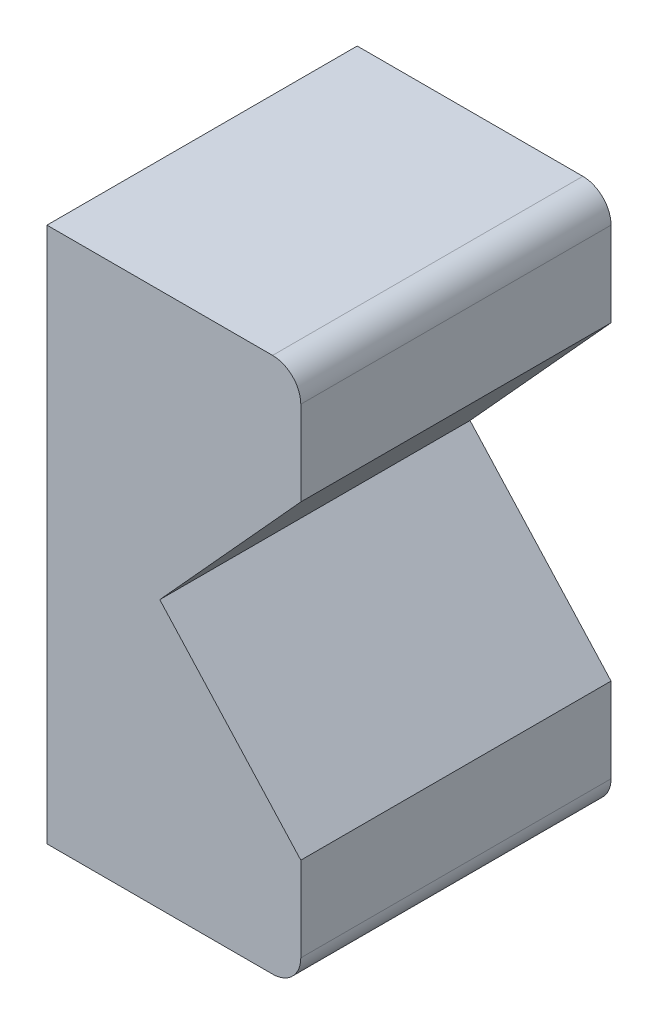
ISO-10303-21;
HEADER;
FILE_DESCRIPTION(('STEP AP214'),'2;1');
FILE_NAME('part.step','',(''),(''),'','','');
FILE_SCHEMA(('AUTOMOTIVE_DESIGN { 1 0 10303 214 1 1 1 1 }'));
ENDSEC;
DATA;
#1=APPLICATION_CONTEXT('core data for automotive mechanical design processes');
#2=APPLICATION_PROTOCOL_DEFINITION('international standard','automotive_design',2000,#1);
#3=PRODUCT_CONTEXT('',#1,'mechanical');
#4=PRODUCT('Part','Part','',(#3));
#5=PRODUCT_RELATED_PRODUCT_CATEGORY('part','',(#4));
#6=PRODUCT_DEFINITION_FORMATION('','',#4);
#7=PRODUCT_DEFINITION_CONTEXT('part definition',#1,'design');
#8=PRODUCT_DEFINITION('design','',#6,#7);
#9=PRODUCT_DEFINITION_SHAPE('','',#8);
#10=(LENGTH_UNIT() NAMED_UNIT(*) SI_UNIT(.MILLI.,.METRE.));
#11=(NAMED_UNIT(*) PLANE_ANGLE_UNIT() SI_UNIT($,.RADIAN.));
#12=(NAMED_UNIT(*) SI_UNIT($,.STERADIAN.) SOLID_ANGLE_UNIT());
#13=UNCERTAINTY_MEASURE_WITH_UNIT(LENGTH_MEASURE(1.E-05),#10,'distance_accuracy_value','');
#14=(GEOMETRIC_REPRESENTATION_CONTEXT(3) GLOBAL_UNCERTAINTY_ASSIGNED_CONTEXT((#13)) GLOBAL_UNIT_ASSIGNED_CONTEXT((#10,
#11,#12)) REPRESENTATION_CONTEXT('',''));
#15=CARTESIAN_POINT('',(0.,0.,0.));
#16=DIRECTION('',(0.,0.,1.));
#17=DIRECTION('',(1.,0.,0.));
#18=AXIS2_PLACEMENT_3D('',#15,#16,#17);
#19=CARTESIAN_POINT('',(0.,0.,11.));
#20=DIRECTION('',(0.,1.,0.));
#21=DIRECTION('',(0.,0.,1.));
#22=AXIS2_PLACEMENT_3D('',#19,#20,#21);
#23=PLANE('',#22);
#24=DIRECTION('',(1.,0.,0.));
#25=VECTOR('',#24,1.);
#26=CARTESIAN_POINT('',(0.,0.,0.));
#27=LINE('',#26,#25);
#28=CARTESIAN_POINT('',(0.,0.,0.));
#29=VERTEX_POINT('',#28);
#30=CARTESIAN_POINT('',(7.99999999999999,0.,0.));
#31=VERTEX_POINT('',#30);
#32=EDGE_CURVE('E137',#29,#31,#27,.T.);
#33=ORIENTED_EDGE('',*,*,#32,.T.);
#34=DIRECTION('',(0.,0.,-1.));
#35=VECTOR('',#34,1.);
#36=CARTESIAN_POINT('',(7.99999999999999,0.,11.));
#37=LINE('',#36,#35);
#38=CARTESIAN_POINT('',(7.99999999999999,0.,11.));
#39=VERTEX_POINT('',#38);
#40=EDGE_CURVE('E11',#39,#31,#37,.T.);
#41=ORIENTED_EDGE('',*,*,#40,.F.);
#42=DIRECTION('',(1.,0.,0.));
#43=VECTOR('',#42,1.);
#44=CARTESIAN_POINT('',(0.,0.,11.));
#45=LINE('',#44,#43);
#46=CARTESIAN_POINT('',(0.,0.,11.));
#47=VERTEX_POINT('',#46);
#48=EDGE_CURVE('E153',#47,#39,#45,.T.);
#49=ORIENTED_EDGE('',*,*,#48,.F.);
#50=DIRECTION('',(0.,0.,-1.));
#51=VECTOR('',#50,1.);
#52=CARTESIAN_POINT('',(0.,0.,11.));
#53=LINE('',#52,#51);
#54=EDGE_CURVE('E133',#47,#29,#53,.T.);
#55=ORIENTED_EDGE('',*,*,#54,.T.);
#56=EDGE_LOOP('',(#33,#41,#49,#55));
#57=FACE_BOUND('',#56,.T.);
#58=ADVANCED_FACE('F35',(#57),#23,.F.);
#59=CARTESIAN_POINT('',(8.,1.,11.));
#60=DIRECTION('',(0.,0.,-1.));
#61=DIRECTION('',(-1.,0.,0.));
#62=AXIS2_PLACEMENT_3D('',#59,#60,#61);
#63=CYLINDRICAL_SURFACE('',#62,1.);
#64=CARTESIAN_POINT('',(8.,1.,0.));
#65=DIRECTION('',(0.,0.,1.));
#66=DIRECTION('',(-1.,0.,0.));
#67=AXIS2_PLACEMENT_3D('',#64,#65,#66);
#68=CIRCLE('',#67,1.);
#69=CARTESIAN_POINT('',(9.,1.00000000000001,0.));
#70=VERTEX_POINT('',#69);
#71=EDGE_CURVE('E140',#31,#70,#68,.T.);
#72=ORIENTED_EDGE('',*,*,#71,.T.);
#73=DIRECTION('',(0.,0.,-1.));
#74=VECTOR('',#73,1.);
#75=CARTESIAN_POINT('',(9.,1.00000000000001,11.));
#76=LINE('',#75,#74);
#77=CARTESIAN_POINT('',(9.,1.00000000000001,11.));
#78=VERTEX_POINT('',#77);
#79=EDGE_CURVE('E43',#78,#70,#76,.T.);
#80=ORIENTED_EDGE('',*,*,#79,.F.);
#81=CARTESIAN_POINT('',(8.,1.,11.));
#82=DIRECTION('',(0.,0.,1.));
#83=DIRECTION('',(-1.,0.,0.));
#84=AXIS2_PLACEMENT_3D('',#81,#82,#83);
#85=CIRCLE('',#84,1.);
#86=EDGE_CURVE('E97',#39,#78,#85,.T.);
#87=ORIENTED_EDGE('',*,*,#86,.F.);
#88=ORIENTED_EDGE('',*,*,#40,.T.);
#89=EDGE_LOOP('',(#72,#80,#87,#88));
#90=FACE_BOUND('',#89,.T.);
#91=ADVANCED_FACE('F196',(#90),#63,.T.);
#92=CARTESIAN_POINT('',(9.,1.00000000000001,11.));
#93=DIRECTION('',(-1.,0.,0.));
#94=DIRECTION('',(0.,0.,1.));
#95=AXIS2_PLACEMENT_3D('',#92,#93,#94);
#96=PLANE('',#95);
#97=DIRECTION('',(0.,1.,0.));
#98=VECTOR('',#97,1.);
#99=CARTESIAN_POINT('',(9.,1.00000000000001,0.));
#100=LINE('',#99,#98);
#101=CARTESIAN_POINT('',(9.,4.,0.));
#102=VERTEX_POINT('',#101);
#103=EDGE_CURVE('E142',#70,#102,#100,.T.);
#104=ORIENTED_EDGE('',*,*,#103,.T.);
#105=DIRECTION('',(0.,0.,-1.));
#106=VECTOR('',#105,1.);
#107=CARTESIAN_POINT('',(9.,4.,11.));
#108=LINE('',#107,#106);
#109=CARTESIAN_POINT('',(9.,4.,11.));
#110=VERTEX_POINT('',#109);
#111=EDGE_CURVE('E163',#110,#102,#108,.T.);
#112=ORIENTED_EDGE('',*,*,#111,.F.);
#113=DIRECTION('',(0.,1.,0.));
#114=VECTOR('',#113,1.);
#115=CARTESIAN_POINT('',(9.,1.00000000000001,11.));
#116=LINE('',#115,#114);
#117=EDGE_CURVE('E171',#78,#110,#116,.T.);
#118=ORIENTED_EDGE('',*,*,#117,.F.);
#119=ORIENTED_EDGE('',*,*,#79,.T.);
#120=EDGE_LOOP('',(#104,#112,#118,#119));
#121=FACE_BOUND('',#120,.T.);
#122=ADVANCED_FACE('F169',(#121),#96,.F.);
#123=CARTESIAN_POINT('',(9.,4.,11.));
#124=DIRECTION('',(-0.739940073395944,-0.672672793996312,0.));
#125=DIRECTION('',(0.672672793996312,-0.739940073395944,0.));
#126=AXIS2_PLACEMENT_3D('',#123,#124,#125);
#127=PLANE('',#126);
#128=DIRECTION('',(-0.672672793996312,0.739940073395944,0.));
#129=VECTOR('',#128,1.);
#130=CARTESIAN_POINT('',(9.,4.,0.));
#131=LINE('',#130,#129);
#132=CARTESIAN_POINT('',(4.,9.5,0.));
#133=VERTEX_POINT('',#132);
#134=EDGE_CURVE('E144',#102,#133,#131,.T.);
#135=ORIENTED_EDGE('',*,*,#134,.T.);
#136=DIRECTION('',(0.,0.,-1.));
#137=VECTOR('',#136,1.);
#138=CARTESIAN_POINT('',(4.,9.5,11.));
#139=LINE('',#138,#137);
#140=CARTESIAN_POINT('',(4.,9.5,11.));
#141=VERTEX_POINT('',#140);
#142=EDGE_CURVE('E160',#141,#133,#139,.T.);
#143=ORIENTED_EDGE('',*,*,#142,.F.);
#144=DIRECTION('',(-0.672672793996312,0.739940073395944,0.));
#145=VECTOR('',#144,1.);
#146=CARTESIAN_POINT('',(9.,4.,11.));
#147=LINE('',#146,#145);
#148=EDGE_CURVE('E187',#110,#141,#147,.T.);
#149=ORIENTED_EDGE('',*,*,#148,.F.);
#150=ORIENTED_EDGE('',*,*,#111,.T.);
#151=EDGE_LOOP('',(#135,#143,#149,#150));
#152=FACE_BOUND('',#151,.T.);
#153=ADVANCED_FACE('F180',(#152),#127,.F.);
#154=CARTESIAN_POINT('',(9.,15.,11.));
#155=DIRECTION('',(-0.739940073395944,0.672672793996312,0.));
#156=DIRECTION('',(-0.672672793996312,-0.739940073395944,0.));
#157=AXIS2_PLACEMENT_3D('',#154,#155,#156);
#158=PLANE('',#157);
#159=DIRECTION('',(0.672672793996312,0.739940073395944,0.));
#160=VECTOR('',#159,1.);
#161=CARTESIAN_POINT('',(9.,15.,0.));
#162=LINE('',#161,#160);
#163=CARTESIAN_POINT('',(9.,15.,0.));
#164=VERTEX_POINT('',#163);
#165=EDGE_CURVE('E146',#133,#164,#162,.T.);
#166=ORIENTED_EDGE('',*,*,#165,.T.);
#167=DIRECTION('',(0.,0.,-1.));
#168=VECTOR('',#167,1.);
#169=CARTESIAN_POINT('',(9.,15.,11.));
#170=LINE('',#169,#168);
#171=CARTESIAN_POINT('',(9.,15.,11.));
#172=VERTEX_POINT('',#171);
#173=EDGE_CURVE('E157',#172,#164,#170,.T.);
#174=ORIENTED_EDGE('',*,*,#173,.F.);
#175=DIRECTION('',(0.672672793996312,0.739940073395944,0.));
#176=VECTOR('',#175,1.);
#177=CARTESIAN_POINT('',(9.,15.,11.));
#178=LINE('',#177,#176);
#179=EDGE_CURVE('E186',#141,#172,#178,.T.);
#180=ORIENTED_EDGE('',*,*,#179,.F.);
#181=ORIENTED_EDGE('',*,*,#142,.T.);
#182=EDGE_LOOP('',(#166,#174,#180,#181));
#183=FACE_BOUND('',#182,.T.);
#184=ADVANCED_FACE('F184',(#183),#158,.F.);
#185=CARTESIAN_POINT('',(9.,18.,11.));
#186=DIRECTION('',(-1.,0.,0.));
#187=DIRECTION('',(0.,0.,1.));
#188=AXIS2_PLACEMENT_3D('',#185,#186,#187);
#189=PLANE('',#188);
#190=DIRECTION('',(0.,1.,0.));
#191=VECTOR('',#190,1.);
#192=CARTESIAN_POINT('',(9.,18.,0.));
#193=LINE('',#192,#191);
#194=CARTESIAN_POINT('',(9.,18.,0.));
#195=VERTEX_POINT('',#194);
#196=EDGE_CURVE('E148',#164,#195,#193,.T.);
#197=ORIENTED_EDGE('',*,*,#196,.T.);
#198=DIRECTION('',(0.,0.,-1.));
#199=VECTOR('',#198,1.);
#200=CARTESIAN_POINT('',(9.,18.,11.));
#201=LINE('',#200,#199);
#202=CARTESIAN_POINT('',(9.,18.,11.));
#203=VERTEX_POINT('',#202);
#204=EDGE_CURVE('E128',#203,#195,#201,.T.);
#205=ORIENTED_EDGE('',*,*,#204,.F.);
#206=DIRECTION('',(0.,1.,0.));
#207=VECTOR('',#206,1.);
#208=CARTESIAN_POINT('',(9.,18.,11.));
#209=LINE('',#208,#207);
#210=EDGE_CURVE('E119',#172,#203,#209,.T.);
#211=ORIENTED_EDGE('',*,*,#210,.F.);
#212=ORIENTED_EDGE('',*,*,#173,.T.);
#213=EDGE_LOOP('',(#197,#205,#211,#212));
#214=FACE_BOUND('',#213,.T.);
#215=ADVANCED_FACE('F208',(#214),#189,.F.);
#216=CARTESIAN_POINT('',(8.,18.,11.));
#217=DIRECTION('',(0.,0.,-1.));
#218=DIRECTION('',(-1.,0.,0.));
#219=AXIS2_PLACEMENT_3D('',#216,#217,#218);
#220=CYLINDRICAL_SURFACE('',#219,1.);
#221=CARTESIAN_POINT('',(8.,18.,0.));
#222=DIRECTION('',(0.,0.,1.));
#223=DIRECTION('',(1.,0.,0.));
#224=AXIS2_PLACEMENT_3D('',#221,#222,#223);
#225=CIRCLE('',#224,1.);
#226=CARTESIAN_POINT('',(7.99999999999999,19.,0.));
#227=VERTEX_POINT('',#226);
#228=EDGE_CURVE('E127',#195,#227,#225,.T.);
#229=ORIENTED_EDGE('',*,*,#228,.T.);
#230=DIRECTION('',(0.,0.,-1.));
#231=VECTOR('',#230,1.);
#232=CARTESIAN_POINT('',(7.99999999999999,19.,11.));
#233=LINE('',#232,#231);
#234=CARTESIAN_POINT('',(7.99999999999999,19.,11.));
#235=VERTEX_POINT('',#234);
#236=EDGE_CURVE('E124',#235,#227,#233,.T.);
#237=ORIENTED_EDGE('',*,*,#236,.F.);
#238=CARTESIAN_POINT('',(8.,18.,11.));
#239=DIRECTION('',(0.,0.,1.));
#240=DIRECTION('',(1.,0.,0.));
#241=AXIS2_PLACEMENT_3D('',#238,#239,#240);
#242=CIRCLE('',#241,1.);
#243=EDGE_CURVE('E113',#203,#235,#242,.T.);
#244=ORIENTED_EDGE('',*,*,#243,.F.);
#245=ORIENTED_EDGE('',*,*,#204,.T.);
#246=EDGE_LOOP('',(#229,#237,#244,#245));
#247=FACE_BOUND('',#246,.T.);
#248=ADVANCED_FACE('F125',(#247),#220,.T.);
#249=CARTESIAN_POINT('',(0.,19.,11.));
#250=DIRECTION('',(0.,-1.,0.));
#251=DIRECTION('',(0.,0.,-1.));
#252=AXIS2_PLACEMENT_3D('',#249,#250,#251);
#253=PLANE('',#252);
#254=DIRECTION('',(-1.,0.,0.));
#255=VECTOR('',#254,1.);
#256=CARTESIAN_POINT('',(0.,19.,0.));
#257=LINE('',#256,#255);
#258=CARTESIAN_POINT('',(0.,19.,0.));
#259=VERTEX_POINT('',#258);
#260=EDGE_CURVE('E83',#227,#259,#257,.T.);
#261=ORIENTED_EDGE('',*,*,#260,.T.);
#262=DIRECTION('',(0.,0.,-1.));
#263=VECTOR('',#262,1.);
#264=CARTESIAN_POINT('',(0.,19.,11.));
#265=LINE('',#264,#263);
#266=CARTESIAN_POINT('',(0.,19.,11.));
#267=VERTEX_POINT('',#266);
#268=EDGE_CURVE('E129',#267,#259,#265,.T.);
#269=ORIENTED_EDGE('',*,*,#268,.F.);
#270=DIRECTION('',(-1.,0.,0.));
#271=VECTOR('',#270,1.);
#272=CARTESIAN_POINT('',(0.,19.,11.));
#273=LINE('',#272,#271);
#274=EDGE_CURVE('E117',#235,#267,#273,.T.);
#275=ORIENTED_EDGE('',*,*,#274,.F.);
#276=ORIENTED_EDGE('',*,*,#236,.T.);
#277=EDGE_LOOP('',(#261,#269,#275,#276));
#278=FACE_BOUND('',#277,.T.);
#279=ADVANCED_FACE('F131',(#278),#253,.F.);
#280=CARTESIAN_POINT('',(0.,0.,11.));
#281=DIRECTION('',(1.,0.,0.));
#282=DIRECTION('',(0.,0.,-1.));
#283=AXIS2_PLACEMENT_3D('',#280,#281,#282);
#284=PLANE('',#283);
#285=DIRECTION('',(0.,-1.,0.));
#286=VECTOR('',#285,1.);
#287=CARTESIAN_POINT('',(0.,0.,0.));
#288=LINE('',#287,#286);
#289=EDGE_CURVE('E89',#259,#29,#288,.T.);
#290=ORIENTED_EDGE('',*,*,#289,.T.);
#291=ORIENTED_EDGE('',*,*,#54,.F.);
#292=DIRECTION('',(0.,-1.,0.));
#293=VECTOR('',#292,1.);
#294=CARTESIAN_POINT('',(0.,0.,11.));
#295=LINE('',#294,#293);
#296=EDGE_CURVE('E51',#267,#47,#295,.T.);
#297=ORIENTED_EDGE('',*,*,#296,.F.);
#298=ORIENTED_EDGE('',*,*,#268,.T.);
#299=EDGE_LOOP('',(#290,#291,#297,#298));
#300=FACE_BOUND('',#299,.T.);
#301=ADVANCED_FACE('F216',(#300),#284,.F.);
#302=CARTESIAN_POINT('',(8.,1.,11.));
#303=DIRECTION('',(0.,0.,-1.));
#304=DIRECTION('',(-1.,0.,0.));
#305=AXIS2_PLACEMENT_3D('',#302,#303,#304);
#306=PLANE('',#305);
#307=ORIENTED_EDGE('',*,*,#48,.T.);
#308=ORIENTED_EDGE('',*,*,#86,.T.);
#309=ORIENTED_EDGE('',*,*,#117,.T.);
#310=ORIENTED_EDGE('',*,*,#148,.T.);
#311=ORIENTED_EDGE('',*,*,#179,.T.);
#312=ORIENTED_EDGE('',*,*,#210,.T.);
#313=ORIENTED_EDGE('',*,*,#243,.T.);
#314=ORIENTED_EDGE('',*,*,#274,.T.);
#315=ORIENTED_EDGE('',*,*,#296,.T.);
#316=EDGE_LOOP('',(#307,#308,#309,#310,#311,#312,#313,#314,#315));
#317=FACE_BOUND('',#316,.T.);
#318=ADVANCED_FACE('F115',(#317),#306,.F.);
#319=CARTESIAN_POINT('',(8.,1.,0.));
#320=DIRECTION('',(0.,0.,-1.));
#321=DIRECTION('',(-1.,0.,0.));
#322=AXIS2_PLACEMENT_3D('',#319,#320,#321);
#323=PLANE('',#322);
#324=ORIENTED_EDGE('',*,*,#32,.F.);
#325=ORIENTED_EDGE('',*,*,#289,.F.);
#326=ORIENTED_EDGE('',*,*,#260,.F.);
#327=ORIENTED_EDGE('',*,*,#228,.F.);
#328=ORIENTED_EDGE('',*,*,#196,.F.);
#329=ORIENTED_EDGE('',*,*,#165,.F.);
#330=ORIENTED_EDGE('',*,*,#134,.F.);
#331=ORIENTED_EDGE('',*,*,#103,.F.);
#332=ORIENTED_EDGE('',*,*,#71,.F.);
#333=EDGE_LOOP('',(#324,#325,#326,#327,#328,#329,#330,#331,#332));
#334=FACE_BOUND('',#333,.T.);
#335=ADVANCED_FACE('F175',(#334),#323,.T.);
#336=CLOSED_SHELL('',(#58,#91,#122,#153,#184,#215,#248,#279,#301,#318,#335));
#337=MANIFOLD_SOLID_BREP('B2',#336);
#338=ADVANCED_BREP_SHAPE_REPRESENTATION('',(#18,#337),#14);
#339=SHAPE_DEFINITION_REPRESENTATION(#9,#338);
ENDSEC;
END-ISO-10303-21;
